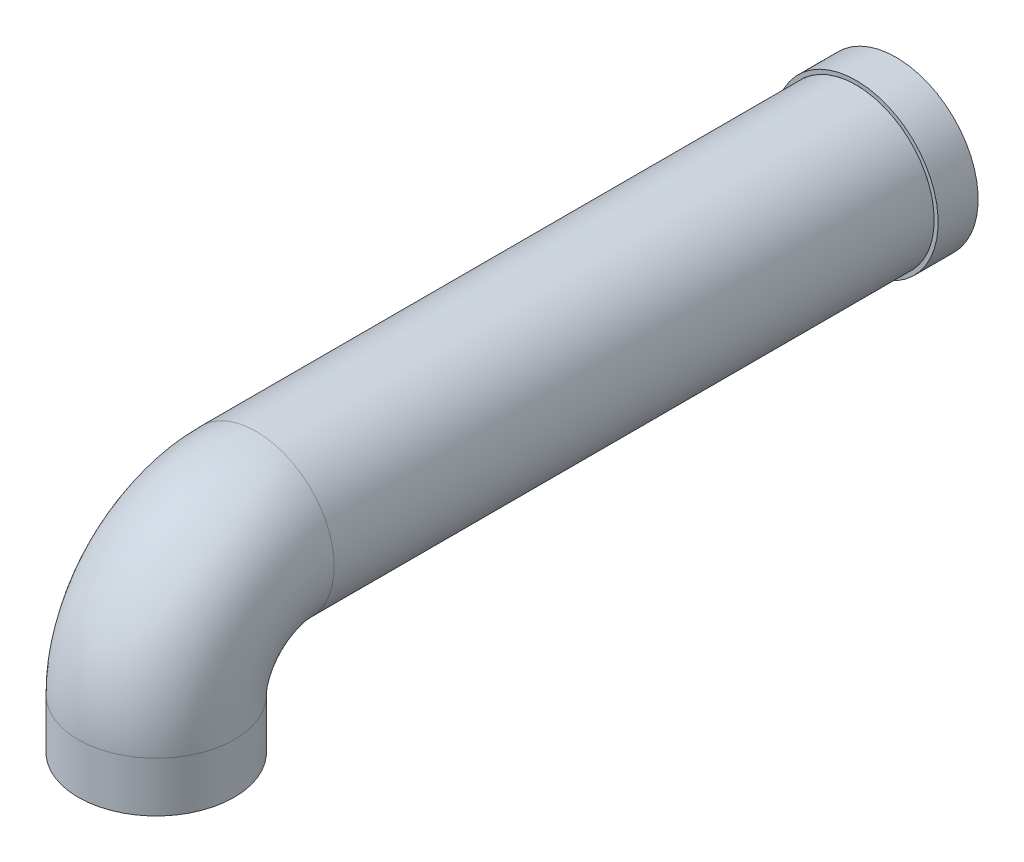
ISO-10303-21;
HEADER;
FILE_DESCRIPTION(('STEP AP214'),'2;1');
FILE_NAME('part.step','',(''),(''),'','','');
FILE_SCHEMA(('AUTOMOTIVE_DESIGN { 1 0 10303 214 1 1 1 1 }'));
ENDSEC;
DATA;
#1=APPLICATION_CONTEXT('core data for automotive mechanical design processes');
#2=APPLICATION_PROTOCOL_DEFINITION('international standard','automotive_design',2000,#1);
#3=PRODUCT_CONTEXT('',#1,'mechanical');
#4=PRODUCT('Part','Part','',(#3));
#5=PRODUCT_RELATED_PRODUCT_CATEGORY('part','',(#4));
#6=PRODUCT_DEFINITION_FORMATION('','',#4);
#7=PRODUCT_DEFINITION_CONTEXT('part definition',#1,'design');
#8=PRODUCT_DEFINITION('design','',#6,#7);
#9=PRODUCT_DEFINITION_SHAPE('','',#8);
#10=(LENGTH_UNIT() NAMED_UNIT(*) SI_UNIT(.MILLI.,.METRE.));
#11=(NAMED_UNIT(*) PLANE_ANGLE_UNIT() SI_UNIT($,.RADIAN.));
#12=(NAMED_UNIT(*) SI_UNIT($,.STERADIAN.) SOLID_ANGLE_UNIT());
#13=UNCERTAINTY_MEASURE_WITH_UNIT(LENGTH_MEASURE(1.E-05),#10,'distance_accuracy_value','');
#14=(GEOMETRIC_REPRESENTATION_CONTEXT(3) GLOBAL_UNCERTAINTY_ASSIGNED_CONTEXT((#13)) GLOBAL_UNIT_ASSIGNED_CONTEXT((#10,
#11,#12)) REPRESENTATION_CONTEXT('',''));
#15=CARTESIAN_POINT('',(0.,0.,0.));
#16=DIRECTION('',(0.,0.,1.));
#17=DIRECTION('',(1.,0.,0.));
#18=AXIS2_PLACEMENT_3D('',#15,#16,#17);
#19=CARTESIAN_POINT('',(0.,75.,-370.));
#20=DIRECTION('',(0.,0.,-1.));
#21=DIRECTION('',(-1.,0.,0.));
#22=AXIS2_PLACEMENT_3D('',#19,#20,#21);
#23=PLANE('',#22);
#24=CARTESIAN_POINT('',(0.,75.,-370.));
#25=DIRECTION('',(0.,0.,-1.));
#26=DIRECTION('',(-1.,0.,0.));
#27=AXIS2_PLACEMENT_3D('',#24,#25,#26);
#28=CIRCLE('',#27,41.);
#29=CARTESIAN_POINT('',(-41.,75.,-370.));
#30=VERTEX_POINT('',#29);
#31=EDGE_CURVE('E12',#30,#30,#28,.T.);
#32=ORIENTED_EDGE('',*,*,#31,.T.);
#33=EDGE_LOOP('',(#32));
#34=FACE_BOUND('',#33,.T.);
#35=CARTESIAN_POINT('',(0.,75.,-370.));
#36=DIRECTION('',(0.,0.,-1.));
#37=DIRECTION('',(-1.,0.,0.));
#38=AXIS2_PLACEMENT_3D('',#35,#36,#37);
#39=CIRCLE('',#38,39.);
#40=CARTESIAN_POINT('',(-39.,75.,-370.));
#41=VERTEX_POINT('',#40);
#42=EDGE_CURVE('E61',#41,#41,#39,.T.);
#43=ORIENTED_EDGE('',*,*,#42,.F.);
#44=EDGE_LOOP('',(#43));
#45=FACE_BOUND('',#44,.T.);
#46=ADVANCED_FACE('F50',(#34,#45),#23,.T.);
#47=CARTESIAN_POINT('',(0.,75.,-350.));
#48=DIRECTION('',(0.,0.,-1.));
#49=DIRECTION('',(-1.,0.,0.));
#50=AXIS2_PLACEMENT_3D('',#47,#48,#49);
#51=PLANE('',#50);
#52=CARTESIAN_POINT('',(0.,75.,-350.));
#53=DIRECTION('',(0.,0.,-1.));
#54=DIRECTION('',(-1.,0.,0.));
#55=AXIS2_PLACEMENT_3D('',#52,#53,#54);
#56=CIRCLE('',#55,41.);
#57=CARTESIAN_POINT('',(-41.,75.,-350.));
#58=VERTEX_POINT('',#57);
#59=EDGE_CURVE('E54',#58,#58,#56,.T.);
#60=ORIENTED_EDGE('',*,*,#59,.F.);
#61=EDGE_LOOP('',(#60));
#62=FACE_BOUND('',#61,.T.);
#63=CARTESIAN_POINT('',(0.,75.,-350.));
#64=DIRECTION('',(0.,0.,-1.));
#65=DIRECTION('',(-1.,0.,0.));
#66=AXIS2_PLACEMENT_3D('',#63,#64,#65);
#67=CIRCLE('',#66,39.);
#68=CARTESIAN_POINT('',(-39.,75.,-350.));
#69=VERTEX_POINT('',#68);
#70=EDGE_CURVE('E63',#69,#69,#67,.T.);
#71=ORIENTED_EDGE('',*,*,#70,.T.);
#72=EDGE_LOOP('',(#71));
#73=FACE_BOUND('',#72,.T.);
#74=ADVANCED_FACE('F73',(#62,#73),#51,.F.);
#75=CARTESIAN_POINT('',(0.,75.,-370.));
#76=DIRECTION('',(0.,0.,1.));
#77=DIRECTION('',(1.,0.,0.));
#78=AXIS2_PLACEMENT_3D('',#75,#76,#77);
#79=CYLINDRICAL_SURFACE('',#78,41.);
#80=ORIENTED_EDGE('',*,*,#31,.F.);
#81=EDGE_LOOP('',(#80));
#82=FACE_BOUND('',#81,.T.);
#83=ORIENTED_EDGE('',*,*,#59,.T.);
#84=EDGE_LOOP('',(#83));
#85=FACE_BOUND('',#84,.T.);
#86=ADVANCED_FACE('F52',(#82,#85),#79,.T.);
#87=CARTESIAN_POINT('',(0.,75.,-370.));
#88=DIRECTION('',(0.,0.,1.));
#89=DIRECTION('',(1.,0.,0.));
#90=AXIS2_PLACEMENT_3D('',#87,#88,#89);
#91=CYLINDRICAL_SURFACE('',#90,39.);
#92=ORIENTED_EDGE('',*,*,#42,.T.);
#93=EDGE_LOOP('',(#92));
#94=FACE_BOUND('',#93,.T.);
#95=ORIENTED_EDGE('',*,*,#70,.F.);
#96=EDGE_LOOP('',(#95));
#97=FACE_BOUND('',#96,.T.);
#98=ADVANCED_FACE('F69',(#94,#97),#91,.F.);
#99=CLOSED_SHELL('',(#46,#74,#86,#98));
#100=MANIFOLD_SOLID_BREP('B2',#99);
#101=CARTESIAN_POINT('',(0.,0.,0.));
#102=DIRECTION('',(0.,-1.,0.));
#103=DIRECTION('',(1.,0.,0.));
#104=AXIS2_PLACEMENT_3D('',#101,#102,#103);
#105=PLANE('',#104);
#106=CARTESIAN_POINT('',(0.,0.,0.));
#107=DIRECTION('',(0.,-1.,0.));
#108=DIRECTION('',(1.,0.,0.));
#109=AXIS2_PLACEMENT_3D('',#106,#107,#108);
#110=CIRCLE('',#109,39.);
#111=CARTESIAN_POINT('',(39.,0.,0.));
#112=VERTEX_POINT('',#111);
#113=EDGE_CURVE('E126',#112,#112,#110,.T.);
#114=ORIENTED_EDGE('',*,*,#113,.T.);
#115=EDGE_LOOP('',(#114));
#116=FACE_BOUND('',#115,.T.);
#117=ADVANCED_FACE('F112',(#116),#105,.T.);
#118=CARTESIAN_POINT('',(0.,75.,-350.));
#119=DIRECTION('',(0.,0.,1.));
#120=DIRECTION('',(1.,0.,0.));
#121=AXIS2_PLACEMENT_3D('',#118,#119,#120);
#122=PLANE('',#121);
#123=CARTESIAN_POINT('',(0.,75.,-350.));
#124=DIRECTION('',(0.,0.,-1.));
#125=DIRECTION('',(-1.,0.,0.));
#126=AXIS2_PLACEMENT_3D('',#123,#124,#125);
#127=CIRCLE('',#126,25.);
#128=CARTESIAN_POINT('',(-25.,75.,-350.));
#129=VERTEX_POINT('',#128);
#130=EDGE_CURVE('E132',#129,#129,#127,.T.);
#131=ORIENTED_EDGE('',*,*,#130,.F.);
#132=EDGE_LOOP('',(#131));
#133=FACE_BOUND('',#132,.T.);
#134=CARTESIAN_POINT('',(0.,75.,-350.));
#135=DIRECTION('',(0.,0.,1.));
#136=DIRECTION('',(1.,0.,0.));
#137=AXIS2_PLACEMENT_3D('',#134,#135,#136);
#138=CIRCLE('',#137,39.);
#139=CARTESIAN_POINT('',(39.,75.,-350.));
#140=VERTEX_POINT('',#139);
#141=EDGE_CURVE('E49',#140,#140,#138,.T.);
#142=ORIENTED_EDGE('',*,*,#141,.F.);
#143=EDGE_LOOP('',(#142));
#144=FACE_BOUND('',#143,.T.);
#145=ADVANCED_FACE('F147',(#133,#144),#122,.F.);
#146=CARTESIAN_POINT('',(0.,0.,0.));
#147=DIRECTION('',(0.,1.,0.));
#148=DIRECTION('',(0.,0.,1.));
#149=AXIS2_PLACEMENT_3D('',#146,#147,#148);
#150=CYLINDRICAL_SURFACE('',#149,39.);
#151=CARTESIAN_POINT('',(0.,25.,0.));
#152=DIRECTION('',(0.,-1.,0.));
#153=DIRECTION('',(1.,0.,0.));
#154=AXIS2_PLACEMENT_3D('',#151,#152,#153);
#155=CIRCLE('',#154,39.);
#156=CARTESIAN_POINT('',(0.,25.,39.));
#157=VERTEX_POINT('',#156);
#158=EDGE_CURVE('E122',#157,#157,#155,.T.);
#159=ORIENTED_EDGE('',*,*,#158,.T.);
#160=EDGE_LOOP('',(#159));
#161=FACE_BOUND('',#160,.T.);
#162=ORIENTED_EDGE('',*,*,#113,.F.);
#163=EDGE_LOOP('',(#162));
#164=FACE_BOUND('',#163,.T.);
#165=ADVANCED_FACE('F150',(#161,#164),#150,.T.);
#166=CARTESIAN_POINT('',(0.,25.,-50.));
#167=DIRECTION('',(-1.,0.,0.));
#168=DIRECTION('',(0.,0.,1.));
#169=AXIS2_PLACEMENT_3D('',#166,#167,#168);
#170=TOROIDAL_SURFACE('',#169,50.,39.);
#171=CARTESIAN_POINT('',(0.,75.,-50.));
#172=DIRECTION('',(0.,0.,1.));
#173=DIRECTION('',(1.,0.,0.));
#174=AXIS2_PLACEMENT_3D('',#171,#172,#173);
#175=CIRCLE('',#174,39.);
#176=CARTESIAN_POINT('',(0.,114.,-50.));
#177=VERTEX_POINT('',#176);
#178=EDGE_CURVE('E118',#177,#177,#175,.T.);
#179=CARTESIAN_POINT('',(0.,25.,-50.));
#180=DIRECTION('',(-1.,0.,0.));
#181=DIRECTION('',(0.,0.,1.));
#182=AXIS2_PLACEMENT_3D('',#179,#180,#181);
#183=CIRCLE('',#182,89.);
#184=EDGE_CURVE('',#157,#177,#183,.T.);
#185=ORIENTED_EDGE('',*,*,#158,.F.);
#186=ORIENTED_EDGE('',*,*,#178,.T.);
#187=ORIENTED_EDGE('',*,*,#184,.T.);
#188=ORIENTED_EDGE('',*,*,#184,.F.);
#189=EDGE_LOOP('',(#185,#187,#186,#188));
#190=FACE_BOUND('',#189,.T.);
#191=ADVANCED_FACE('F156',(#190),#170,.T.);
#192=CARTESIAN_POINT('',(0.,75.,-50.));
#193=DIRECTION('',(0.,0.,-1.));
#194=DIRECTION('',(-1.,0.,0.));
#195=AXIS2_PLACEMENT_3D('',#192,#193,#194);
#196=CYLINDRICAL_SURFACE('',#195,39.);
#197=ORIENTED_EDGE('',*,*,#141,.T.);
#198=EDGE_LOOP('',(#197));
#199=FACE_BOUND('',#198,.T.);
#200=ORIENTED_EDGE('',*,*,#178,.F.);
#201=EDGE_LOOP('',(#200));
#202=FACE_BOUND('',#201,.T.);
#203=ADVANCED_FACE('F143',(#199,#202),#196,.T.);
#204=CARTESIAN_POINT('',(0.,75.,-50.));
#205=DIRECTION('',(0.,0.,-1.));
#206=DIRECTION('',(-1.,0.,0.));
#207=AXIS2_PLACEMENT_3D('',#204,#205,#206);
#208=CYLINDRICAL_SURFACE('',#207,25.);
#209=CARTESIAN_POINT('',(0.,75.,-50.));
#210=DIRECTION('',(0.,0.,-1.));
#211=DIRECTION('',(-1.,0.,0.));
#212=AXIS2_PLACEMENT_3D('',#209,#210,#211);
#213=CIRCLE('',#212,25.);
#214=CARTESIAN_POINT('',(-25.,75.,-50.));
#215=VERTEX_POINT('',#214);
#216=EDGE_CURVE('E131',#215,#215,#213,.T.);
#217=ORIENTED_EDGE('',*,*,#216,.F.);
#218=EDGE_LOOP('',(#217));
#219=FACE_BOUND('',#218,.T.);
#220=ORIENTED_EDGE('',*,*,#130,.T.);
#221=EDGE_LOOP('',(#220));
#222=FACE_BOUND('',#221,.T.);
#223=ADVANCED_FACE('F140',(#219,#222),#208,.F.);
#224=CARTESIAN_POINT('',(0.,75.,-50.));
#225=DIRECTION('',(0.,0.,-1.));
#226=DIRECTION('',(-1.,0.,0.));
#227=AXIS2_PLACEMENT_3D('',#224,#225,#226);
#228=PLANE('',#227);
#229=ORIENTED_EDGE('',*,*,#216,.T.);
#230=EDGE_LOOP('',(#229));
#231=FACE_BOUND('',#230,.T.);
#232=ADVANCED_FACE('F138',(#231),#228,.T.);
#233=CLOSED_SHELL('',(#117,#145,#165,#191,#203,#223,#232));
#234=MANIFOLD_SOLID_BREP('B7',#233);
#235=ADVANCED_BREP_SHAPE_REPRESENTATION('',(#18,#100,#234),#14);
#236=SHAPE_DEFINITION_REPRESENTATION(#9,#235);
ENDSEC;
END-ISO-10303-21;
